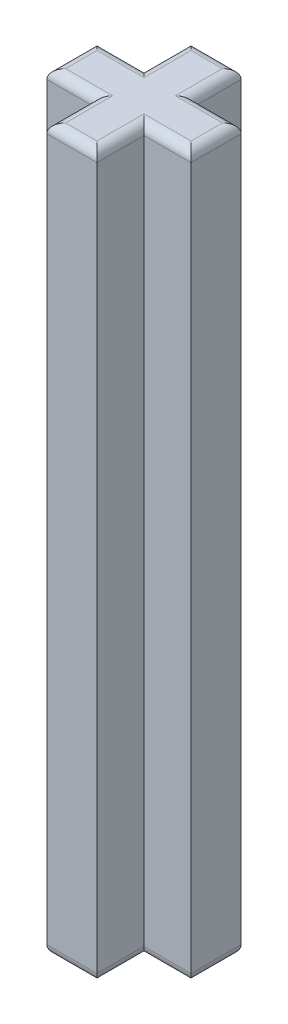
ISO-10303-21;
HEADER;
FILE_DESCRIPTION(('STEP AP214'),'2;1');
FILE_NAME('part.step','',(''),(''),'','','');
FILE_SCHEMA(('AUTOMOTIVE_DESIGN { 1 0 10303 214 1 1 1 1 }'));
ENDSEC;
DATA;
#1=APPLICATION_CONTEXT('core data for automotive mechanical design processes');
#2=APPLICATION_PROTOCOL_DEFINITION('international standard','automotive_design',2000,#1);
#3=PRODUCT_CONTEXT('',#1,'mechanical');
#4=PRODUCT('Part','Part','',(#3));
#5=PRODUCT_RELATED_PRODUCT_CATEGORY('part','',(#4));
#6=PRODUCT_DEFINITION_FORMATION('','',#4);
#7=PRODUCT_DEFINITION_CONTEXT('part definition',#1,'design');
#8=PRODUCT_DEFINITION('design','',#6,#7);
#9=PRODUCT_DEFINITION_SHAPE('','',#8);
#10=(LENGTH_UNIT() NAMED_UNIT(*) SI_UNIT(.MILLI.,.METRE.));
#11=(NAMED_UNIT(*) PLANE_ANGLE_UNIT() SI_UNIT($,.RADIAN.));
#12=(NAMED_UNIT(*) SI_UNIT($,.STERADIAN.) SOLID_ANGLE_UNIT());
#13=UNCERTAINTY_MEASURE_WITH_UNIT(LENGTH_MEASURE(1.E-05),#10,'distance_accuracy_value','');
#14=(GEOMETRIC_REPRESENTATION_CONTEXT(3) GLOBAL_UNCERTAINTY_ASSIGNED_CONTEXT((#13)) GLOBAL_UNIT_ASSIGNED_CONTEXT((#10,
#11,#12)) REPRESENTATION_CONTEXT('',''));
#15=CARTESIAN_POINT('',(0.,0.,0.));
#16=DIRECTION('',(0.,0.,1.));
#17=DIRECTION('',(1.,0.,0.));
#18=AXIS2_PLACEMENT_3D('',#15,#16,#17);
#19=CARTESIAN_POINT('',(2.3,23.,0.8));
#20=DIRECTION('',(-1.,0.,0.));
#21=DIRECTION('',(0.,0.,1.));
#22=AXIS2_PLACEMENT_3D('',#19,#20,#21);
#23=PLANE('',#22);
#24=DIRECTION('',(0.,-1.,0.));
#25=VECTOR('',#24,1.);
#26=CARTESIAN_POINT('',(2.3,23.,0.8));
#27=LINE('',#26,#25);
#28=CARTESIAN_POINT('',(2.3,22.7,0.8));
#29=VERTEX_POINT('',#28);
#30=CARTESIAN_POINT('',(2.3,0.300000000000002,0.8));
#31=VERTEX_POINT('',#30);
#32=EDGE_CURVE('E426',#29,#31,#27,.T.);
#33=ORIENTED_EDGE('',*,*,#32,.T.);
#34=DIRECTION('',(0.,0.,-1.));
#35=VECTOR('',#34,1.);
#36=CARTESIAN_POINT('',(2.3,0.300000000000002,-0.8));
#37=LINE('',#36,#35);
#38=CARTESIAN_POINT('',(2.3,0.300000000000002,-0.8));
#39=VERTEX_POINT('',#38);
#40=EDGE_CURVE('E347',#31,#39,#37,.T.);
#41=ORIENTED_EDGE('',*,*,#40,.T.);
#42=DIRECTION('',(0.,-1.,0.));
#43=VECTOR('',#42,1.);
#44=CARTESIAN_POINT('',(2.3,23.,-0.8));
#45=LINE('',#44,#43);
#46=CARTESIAN_POINT('',(2.3,22.7,-0.8));
#47=VERTEX_POINT('',#46);
#48=EDGE_CURVE('E226',#47,#39,#45,.T.);
#49=ORIENTED_EDGE('',*,*,#48,.F.);
#50=DIRECTION('',(0.,0.,-1.));
#51=VECTOR('',#50,1.);
#52=CARTESIAN_POINT('',(2.3,22.7,0.8));
#53=LINE('',#52,#51);
#54=EDGE_CURVE('E344',#47,#29,#53,.F.);
#55=ORIENTED_EDGE('',*,*,#54,.T.);
#56=EDGE_LOOP('',(#33,#41,#49,#55));
#57=FACE_BOUND('',#56,.T.);
#58=ADVANCED_FACE('F39',(#57),#23,.F.);
#59=CARTESIAN_POINT('',(0.8,23.,-0.8));
#60=DIRECTION('',(0.,0.,1.));
#61=DIRECTION('',(1.,0.,0.));
#62=AXIS2_PLACEMENT_3D('',#59,#60,#61);
#63=PLANE('',#62);
#64=ORIENTED_EDGE('',*,*,#48,.T.);
#65=DIRECTION('',(-1.,0.,0.));
#66=VECTOR('',#65,1.);
#67=CARTESIAN_POINT('',(0.8,0.300000000000002,-0.8));
#68=LINE('',#67,#66);
#69=CARTESIAN_POINT('',(0.8,0.300000000000002,-0.8));
#70=VERTEX_POINT('',#69);
#71=EDGE_CURVE('E224',#39,#70,#68,.T.);
#72=ORIENTED_EDGE('',*,*,#71,.T.);
#73=DIRECTION('',(0.,-1.,0.));
#74=VECTOR('',#73,1.);
#75=CARTESIAN_POINT('',(0.8,23.,-0.8));
#76=LINE('',#75,#74);
#77=CARTESIAN_POINT('',(0.8,22.7,-0.8));
#78=VERTEX_POINT('',#77);
#79=EDGE_CURVE('E205',#78,#70,#76,.T.);
#80=ORIENTED_EDGE('',*,*,#79,.F.);
#81=DIRECTION('',(-1.,0.,0.));
#82=VECTOR('',#81,1.);
#83=CARTESIAN_POINT('',(0.8,22.7,-0.8));
#84=LINE('',#83,#82);
#85=EDGE_CURVE('E221',#78,#47,#84,.F.);
#86=ORIENTED_EDGE('',*,*,#85,.T.);
#87=EDGE_LOOP('',(#64,#72,#80,#86));
#88=FACE_BOUND('',#87,.T.);
#89=ADVANCED_FACE('F219',(#88),#63,.F.);
#90=CARTESIAN_POINT('',(0.8,23.,-0.8));
#91=DIRECTION('',(-1.,0.,0.));
#92=DIRECTION('',(0.,0.,1.));
#93=AXIS2_PLACEMENT_3D('',#90,#91,#92);
#94=PLANE('',#93);
#95=ORIENTED_EDGE('',*,*,#79,.T.);
#96=DIRECTION('',(0.,0.,-1.));
#97=VECTOR('',#96,1.);
#98=CARTESIAN_POINT('',(0.8,0.300000000000002,-2.3));
#99=LINE('',#98,#97);
#100=CARTESIAN_POINT('',(0.8,0.300000000000002,-2.3));
#101=VERTEX_POINT('',#100);
#102=EDGE_CURVE('E213',#70,#101,#99,.T.);
#103=ORIENTED_EDGE('',*,*,#102,.T.);
#104=DIRECTION('',(0.,-1.,0.));
#105=VECTOR('',#104,1.);
#106=CARTESIAN_POINT('',(0.8,23.,-2.3));
#107=LINE('',#106,#105);
#108=CARTESIAN_POINT('',(0.8,22.7,-2.3));
#109=VERTEX_POINT('',#108);
#110=EDGE_CURVE('E207',#109,#101,#107,.T.);
#111=ORIENTED_EDGE('',*,*,#110,.F.);
#112=DIRECTION('',(0.,0.,-1.));
#113=VECTOR('',#112,1.);
#114=CARTESIAN_POINT('',(0.8,22.7,-0.8));
#115=LINE('',#114,#113);
#116=EDGE_CURVE('E202',#109,#78,#115,.F.);
#117=ORIENTED_EDGE('',*,*,#116,.T.);
#118=EDGE_LOOP('',(#95,#103,#111,#117));
#119=FACE_BOUND('',#118,.T.);
#120=ADVANCED_FACE('F204',(#119),#94,.F.);
#121=CARTESIAN_POINT('',(-0.8,23.,-2.3));
#122=DIRECTION('',(0.,0.,1.));
#123=DIRECTION('',(1.,0.,0.));
#124=AXIS2_PLACEMENT_3D('',#121,#122,#123);
#125=PLANE('',#124);
#126=ORIENTED_EDGE('',*,*,#110,.T.);
#127=DIRECTION('',(-1.,0.,0.));
#128=VECTOR('',#127,1.);
#129=CARTESIAN_POINT('',(-0.8,0.300000000000002,-2.3));
#130=LINE('',#129,#128);
#131=CARTESIAN_POINT('',(-0.8,0.300000000000002,-2.3));
#132=VERTEX_POINT('',#131);
#133=EDGE_CURVE('E292',#101,#132,#130,.T.);
#134=ORIENTED_EDGE('',*,*,#133,.T.);
#135=DIRECTION('',(0.,-1.,0.));
#136=VECTOR('',#135,1.);
#137=CARTESIAN_POINT('',(-0.8,23.,-2.3));
#138=LINE('',#137,#136);
#139=CARTESIAN_POINT('',(-0.8,22.7,-2.3));
#140=VERTEX_POINT('',#139);
#141=EDGE_CURVE('E488',#140,#132,#138,.T.);
#142=ORIENTED_EDGE('',*,*,#141,.F.);
#143=DIRECTION('',(-1.,0.,0.));
#144=VECTOR('',#143,1.);
#145=CARTESIAN_POINT('',(-0.8,22.7,-2.3));
#146=LINE('',#145,#144);
#147=EDGE_CURVE('E289',#140,#109,#146,.F.);
#148=ORIENTED_EDGE('',*,*,#147,.T.);
#149=EDGE_LOOP('',(#126,#134,#142,#148));
#150=FACE_BOUND('',#149,.T.);
#151=ADVANCED_FACE('F500',(#150),#125,.F.);
#152=CARTESIAN_POINT('',(-0.8,23.,-0.8));
#153=DIRECTION('',(1.,0.,0.));
#154=DIRECTION('',(0.,0.,-1.));
#155=AXIS2_PLACEMENT_3D('',#152,#153,#154);
#156=PLANE('',#155);
#157=ORIENTED_EDGE('',*,*,#141,.T.);
#158=DIRECTION('',(0.,0.,1.));
#159=VECTOR('',#158,1.);
#160=CARTESIAN_POINT('',(-0.8,0.300000000000002,-0.8));
#161=LINE('',#160,#159);
#162=CARTESIAN_POINT('',(-0.8,0.300000000000002,-0.8));
#163=VERTEX_POINT('',#162);
#164=EDGE_CURVE('E298',#132,#163,#161,.T.);
#165=ORIENTED_EDGE('',*,*,#164,.T.);
#166=DIRECTION('',(0.,-1.,0.));
#167=VECTOR('',#166,1.);
#168=CARTESIAN_POINT('',(-0.8,23.,-0.8));
#169=LINE('',#168,#167);
#170=CARTESIAN_POINT('',(-0.8,22.7,-0.8));
#171=VERTEX_POINT('',#170);
#172=EDGE_CURVE('E478',#171,#163,#169,.T.);
#173=ORIENTED_EDGE('',*,*,#172,.F.);
#174=DIRECTION('',(0.,0.,1.));
#175=VECTOR('',#174,1.);
#176=CARTESIAN_POINT('',(-0.8,22.7,-0.8));
#177=LINE('',#176,#175);
#178=EDGE_CURVE('E295',#171,#140,#177,.F.);
#179=ORIENTED_EDGE('',*,*,#178,.T.);
#180=EDGE_LOOP('',(#157,#165,#173,#179));
#181=FACE_BOUND('',#180,.T.);
#182=ADVANCED_FACE('F484',(#181),#156,.F.);
#183=CARTESIAN_POINT('',(-2.3,23.,-0.8));
#184=DIRECTION('',(0.,0.,1.));
#185=DIRECTION('',(1.,0.,0.));
#186=AXIS2_PLACEMENT_3D('',#183,#184,#185);
#187=PLANE('',#186);
#188=ORIENTED_EDGE('',*,*,#172,.T.);
#189=DIRECTION('',(-1.,0.,0.));
#190=VECTOR('',#189,1.);
#191=CARTESIAN_POINT('',(-2.3,0.300000000000002,-0.8));
#192=LINE('',#191,#190);
#193=CARTESIAN_POINT('',(-2.3,0.300000000000002,-0.8));
#194=VERTEX_POINT('',#193);
#195=EDGE_CURVE('E304',#163,#194,#192,.T.);
#196=ORIENTED_EDGE('',*,*,#195,.T.);
#197=DIRECTION('',(0.,-1.,0.));
#198=VECTOR('',#197,1.);
#199=CARTESIAN_POINT('',(-2.3,23.,-0.8));
#200=LINE('',#199,#198);
#201=CARTESIAN_POINT('',(-2.3,22.7,-0.8));
#202=VERTEX_POINT('',#201);
#203=EDGE_CURVE('E481',#202,#194,#200,.T.);
#204=ORIENTED_EDGE('',*,*,#203,.F.);
#205=DIRECTION('',(-1.,0.,0.));
#206=VECTOR('',#205,1.);
#207=CARTESIAN_POINT('',(-2.3,22.7,-0.8));
#208=LINE('',#207,#206);
#209=EDGE_CURVE('E301',#202,#171,#208,.F.);
#210=ORIENTED_EDGE('',*,*,#209,.T.);
#211=EDGE_LOOP('',(#188,#196,#204,#210));
#212=FACE_BOUND('',#211,.T.);
#213=ADVANCED_FACE('F477',(#212),#187,.F.);
#214=CARTESIAN_POINT('',(-2.3,23.,0.8));
#215=DIRECTION('',(1.,0.,0.));
#216=DIRECTION('',(0.,0.,-1.));
#217=AXIS2_PLACEMENT_3D('',#214,#215,#216);
#218=PLANE('',#217);
#219=ORIENTED_EDGE('',*,*,#203,.T.);
#220=DIRECTION('',(0.,0.,1.));
#221=VECTOR('',#220,1.);
#222=CARTESIAN_POINT('',(-2.3,0.300000000000002,0.8));
#223=LINE('',#222,#221);
#224=CARTESIAN_POINT('',(-2.3,0.300000000000002,0.8));
#225=VERTEX_POINT('',#224);
#226=EDGE_CURVE('E310',#194,#225,#223,.T.);
#227=ORIENTED_EDGE('',*,*,#226,.T.);
#228=DIRECTION('',(0.,-1.,0.));
#229=VECTOR('',#228,1.);
#230=CARTESIAN_POINT('',(-2.3,23.,0.8));
#231=LINE('',#230,#229);
#232=CARTESIAN_POINT('',(-2.3,22.7,0.8));
#233=VERTEX_POINT('',#232);
#234=EDGE_CURVE('E493',#233,#225,#231,.T.);
#235=ORIENTED_EDGE('',*,*,#234,.F.);
#236=DIRECTION('',(0.,0.,1.));
#237=VECTOR('',#236,1.);
#238=CARTESIAN_POINT('',(-2.3,22.7,0.8));
#239=LINE('',#238,#237);
#240=EDGE_CURVE('E307',#233,#202,#239,.F.);
#241=ORIENTED_EDGE('',*,*,#240,.T.);
#242=EDGE_LOOP('',(#219,#227,#235,#241));
#243=FACE_BOUND('',#242,.T.);
#244=ADVANCED_FACE('F826',(#243),#218,.F.);
#245=CARTESIAN_POINT('',(-2.3,23.,0.8));
#246=DIRECTION('',(0.,0.,-1.));
#247=DIRECTION('',(-1.,0.,0.));
#248=AXIS2_PLACEMENT_3D('',#245,#246,#247);
#249=PLANE('',#248);
#250=ORIENTED_EDGE('',*,*,#234,.T.);
#251=DIRECTION('',(1.,0.,0.));
#252=VECTOR('',#251,1.);
#253=CARTESIAN_POINT('',(-0.8,0.300000000000002,0.8));
#254=LINE('',#253,#252);
#255=CARTESIAN_POINT('',(-0.8,0.300000000000002,0.8));
#256=VERTEX_POINT('',#255);
#257=EDGE_CURVE('E316',#225,#256,#254,.T.);
#258=ORIENTED_EDGE('',*,*,#257,.T.);
#259=DIRECTION('',(0.,-1.,0.));
#260=VECTOR('',#259,1.);
#261=CARTESIAN_POINT('',(-0.8,23.,0.8));
#262=LINE('',#261,#260);
#263=CARTESIAN_POINT('',(-0.8,22.7,0.8));
#264=VERTEX_POINT('',#263);
#265=EDGE_CURVE('E895',#264,#256,#262,.T.);
#266=ORIENTED_EDGE('',*,*,#265,.F.);
#267=DIRECTION('',(1.,0.,0.));
#268=VECTOR('',#267,1.);
#269=CARTESIAN_POINT('',(-2.3,22.7,0.8));
#270=LINE('',#269,#268);
#271=EDGE_CURVE('E313',#264,#233,#270,.F.);
#272=ORIENTED_EDGE('',*,*,#271,.T.);
#273=EDGE_LOOP('',(#250,#258,#266,#272));
#274=FACE_BOUND('',#273,.T.);
#275=ADVANCED_FACE('F817',(#274),#249,.F.);
#276=CARTESIAN_POINT('',(-0.8,23.,2.3));
#277=DIRECTION('',(1.,0.,0.));
#278=DIRECTION('',(0.,0.,-1.));
#279=AXIS2_PLACEMENT_3D('',#276,#277,#278);
#280=PLANE('',#279);
#281=ORIENTED_EDGE('',*,*,#265,.T.);
#282=DIRECTION('',(0.,0.,1.));
#283=VECTOR('',#282,1.);
#284=CARTESIAN_POINT('',(-0.8,0.300000000000002,2.3));
#285=LINE('',#284,#283);
#286=CARTESIAN_POINT('',(-0.8,0.300000000000002,2.3));
#287=VERTEX_POINT('',#286);
#288=EDGE_CURVE('E322',#256,#287,#285,.T.);
#289=ORIENTED_EDGE('',*,*,#288,.T.);
#290=DIRECTION('',(0.,-1.,0.));
#291=VECTOR('',#290,1.);
#292=CARTESIAN_POINT('',(-0.8,23.,2.3));
#293=LINE('',#292,#291);
#294=CARTESIAN_POINT('',(-0.8,22.7,2.3));
#295=VERTEX_POINT('',#294);
#296=EDGE_CURVE('E898',#295,#287,#293,.T.);
#297=ORIENTED_EDGE('',*,*,#296,.F.);
#298=DIRECTION('',(0.,0.,1.));
#299=VECTOR('',#298,1.);
#300=CARTESIAN_POINT('',(-0.8,22.7,2.3));
#301=LINE('',#300,#299);
#302=EDGE_CURVE('E319',#295,#264,#301,.F.);
#303=ORIENTED_EDGE('',*,*,#302,.T.);
#304=EDGE_LOOP('',(#281,#289,#297,#303));
#305=FACE_BOUND('',#304,.T.);
#306=ADVANCED_FACE('F808',(#305),#280,.F.);
#307=CARTESIAN_POINT('',(-0.8,23.,2.3));
#308=DIRECTION('',(0.,0.,-1.));
#309=DIRECTION('',(-1.,0.,0.));
#310=AXIS2_PLACEMENT_3D('',#307,#308,#309);
#311=PLANE('',#310);
#312=ORIENTED_EDGE('',*,*,#296,.T.);
#313=DIRECTION('',(1.,0.,0.));
#314=VECTOR('',#313,1.);
#315=CARTESIAN_POINT('',(0.8,0.300000000000002,2.3));
#316=LINE('',#315,#314);
#317=CARTESIAN_POINT('',(0.8,0.300000000000002,2.3));
#318=VERTEX_POINT('',#317);
#319=EDGE_CURVE('E328',#287,#318,#316,.T.);
#320=ORIENTED_EDGE('',*,*,#319,.T.);
#321=DIRECTION('',(0.,-1.,0.));
#322=VECTOR('',#321,1.);
#323=CARTESIAN_POINT('',(0.8,23.,2.3));
#324=LINE('',#323,#322);
#325=CARTESIAN_POINT('',(0.8,22.7,2.3));
#326=VERTEX_POINT('',#325);
#327=EDGE_CURVE('E904',#326,#318,#324,.T.);
#328=ORIENTED_EDGE('',*,*,#327,.F.);
#329=DIRECTION('',(1.,0.,0.));
#330=VECTOR('',#329,1.);
#331=CARTESIAN_POINT('',(-0.8,22.7,2.3));
#332=LINE('',#331,#330);
#333=EDGE_CURVE('E325',#326,#295,#332,.F.);
#334=ORIENTED_EDGE('',*,*,#333,.T.);
#335=EDGE_LOOP('',(#312,#320,#328,#334));
#336=FACE_BOUND('',#335,.T.);
#337=ADVANCED_FACE('F799',(#336),#311,.F.);
#338=CARTESIAN_POINT('',(0.8,23.,2.3));
#339=DIRECTION('',(-1.,0.,0.));
#340=DIRECTION('',(0.,0.,1.));
#341=AXIS2_PLACEMENT_3D('',#338,#339,#340);
#342=PLANE('',#341);
#343=ORIENTED_EDGE('',*,*,#327,.T.);
#344=DIRECTION('',(0.,0.,-1.));
#345=VECTOR('',#344,1.);
#346=CARTESIAN_POINT('',(0.799999999999999,0.300000000000002,0.8));
#347=LINE('',#346,#345);
#348=CARTESIAN_POINT('',(0.799999999999999,0.300000000000002,0.8));
#349=VERTEX_POINT('',#348);
#350=EDGE_CURVE('E334',#318,#349,#347,.T.);
#351=ORIENTED_EDGE('',*,*,#350,.T.);
#352=DIRECTION('',(0.,-1.,0.));
#353=VECTOR('',#352,1.);
#354=CARTESIAN_POINT('',(0.799999999999999,23.,0.8));
#355=LINE('',#354,#353);
#356=CARTESIAN_POINT('',(0.799999999999999,22.7,0.8));
#357=VERTEX_POINT('',#356);
#358=EDGE_CURVE('E908',#357,#349,#355,.T.);
#359=ORIENTED_EDGE('',*,*,#358,.F.);
#360=DIRECTION('',(0.,0.,-1.));
#361=VECTOR('',#360,1.);
#362=CARTESIAN_POINT('',(0.8,22.7,2.3));
#363=LINE('',#362,#361);
#364=EDGE_CURVE('E331',#357,#326,#363,.F.);
#365=ORIENTED_EDGE('',*,*,#364,.T.);
#366=EDGE_LOOP('',(#343,#351,#359,#365));
#367=FACE_BOUND('',#366,.T.);
#368=ADVANCED_FACE('F790',(#367),#342,.F.);
#369=CARTESIAN_POINT('',(0.799999999999999,23.,0.8));
#370=DIRECTION('',(0.,0.,-1.));
#371=DIRECTION('',(-1.,0.,0.));
#372=AXIS2_PLACEMENT_3D('',#369,#370,#371);
#373=PLANE('',#372);
#374=ORIENTED_EDGE('',*,*,#358,.T.);
#375=DIRECTION('',(1.,0.,0.));
#376=VECTOR('',#375,1.);
#377=CARTESIAN_POINT('',(2.3,0.300000000000002,0.8));
#378=LINE('',#377,#376);
#379=EDGE_CURVE('E341',#349,#31,#378,.T.);
#380=ORIENTED_EDGE('',*,*,#379,.T.);
#381=ORIENTED_EDGE('',*,*,#32,.F.);
#382=DIRECTION('',(1.,0.,0.));
#383=VECTOR('',#382,1.);
#384=CARTESIAN_POINT('',(0.799999999999999,22.7,0.8));
#385=LINE('',#384,#383);
#386=EDGE_CURVE('E337',#29,#357,#385,.F.);
#387=ORIENTED_EDGE('',*,*,#386,.T.);
#388=EDGE_LOOP('',(#374,#380,#381,#387));
#389=FACE_BOUND('',#388,.T.);
#390=ADVANCED_FACE('F782',(#389),#373,.F.);
#391=CARTESIAN_POINT('',(0.,23.,0.));
#392=DIRECTION('',(0.,-1.,0.));
#393=DIRECTION('',(0.,0.,-1.));
#394=AXIS2_PLACEMENT_3D('',#391,#392,#393);
#395=PLANE('',#394);
#396=DIRECTION('',(0.,0.,-1.));
#397=VECTOR('',#396,1.);
#398=CARTESIAN_POINT('',(0.499999999999999,23.,0.));
#399=LINE('',#398,#397);
#400=CARTESIAN_POINT('',(0.5,23.,2.));
#401=VERTEX_POINT('',#400);
#402=CARTESIAN_POINT('',(0.5,23.,0.5));
#403=VERTEX_POINT('',#402);
#404=EDGE_CURVE('E49',#401,#403,#399,.T.);
#405=ORIENTED_EDGE('',*,*,#404,.T.);
#406=DIRECTION('',(1.,0.,0.));
#407=VECTOR('',#406,1.);
#408=CARTESIAN_POINT('',(0.,23.,0.500000000000001));
#409=LINE('',#408,#407);
#410=CARTESIAN_POINT('',(2.,23.,0.5));
#411=VERTEX_POINT('',#410);
#412=EDGE_CURVE('E11',#403,#411,#409,.T.);
#413=ORIENTED_EDGE('',*,*,#412,.T.);
#414=DIRECTION('',(0.,0.,-1.));
#415=VECTOR('',#414,1.);
#416=CARTESIAN_POINT('',(2.,23.,0.));
#417=LINE('',#416,#415);
#418=CARTESIAN_POINT('',(2.,23.,-0.5));
#419=VERTEX_POINT('',#418);
#420=EDGE_CURVE('E350',#411,#419,#417,.T.);
#421=ORIENTED_EDGE('',*,*,#420,.T.);
#422=DIRECTION('',(-1.,0.,0.));
#423=VECTOR('',#422,1.);
#424=CARTESIAN_POINT('',(0.,23.,-0.5));
#425=LINE('',#424,#423);
#426=CARTESIAN_POINT('',(0.5,23.,-0.5));
#427=VERTEX_POINT('',#426);
#428=EDGE_CURVE('E353',#419,#427,#425,.T.);
#429=ORIENTED_EDGE('',*,*,#428,.T.);
#430=DIRECTION('',(0.,0.,-1.));
#431=VECTOR('',#430,1.);
#432=CARTESIAN_POINT('',(0.499999999999999,23.,0.));
#433=LINE('',#432,#431);
#434=CARTESIAN_POINT('',(0.5,23.,-2.));
#435=VERTEX_POINT('',#434);
#436=EDGE_CURVE('E232',#427,#435,#433,.T.);
#437=ORIENTED_EDGE('',*,*,#436,.T.);
#438=DIRECTION('',(-1.,0.,0.));
#439=VECTOR('',#438,1.);
#440=CARTESIAN_POINT('',(0.,23.,-2.));
#441=LINE('',#440,#439);
#442=CARTESIAN_POINT('',(-0.5,23.,-2.));
#443=VERTEX_POINT('',#442);
#444=EDGE_CURVE('E358',#435,#443,#441,.T.);
#445=ORIENTED_EDGE('',*,*,#444,.T.);
#446=DIRECTION('',(0.,0.,1.));
#447=VECTOR('',#446,1.);
#448=CARTESIAN_POINT('',(-0.5,23.,0.));
#449=LINE('',#448,#447);
#450=CARTESIAN_POINT('',(-0.5,23.,-0.5));
#451=VERTEX_POINT('',#450);
#452=EDGE_CURVE('E361',#443,#451,#449,.T.);
#453=ORIENTED_EDGE('',*,*,#452,.T.);
#454=DIRECTION('',(-1.,0.,0.));
#455=VECTOR('',#454,1.);
#456=CARTESIAN_POINT('',(0.,23.,-0.5));
#457=LINE('',#456,#455);
#458=CARTESIAN_POINT('',(-2.,23.,-0.5));
#459=VERTEX_POINT('',#458);
#460=EDGE_CURVE('E364',#451,#459,#457,.T.);
#461=ORIENTED_EDGE('',*,*,#460,.T.);
#462=DIRECTION('',(0.,0.,1.));
#463=VECTOR('',#462,1.);
#464=CARTESIAN_POINT('',(-2.,23.,0.));
#465=LINE('',#464,#463);
#466=CARTESIAN_POINT('',(-2.,23.,0.5));
#467=VERTEX_POINT('',#466);
#468=EDGE_CURVE('E367',#459,#467,#465,.T.);
#469=ORIENTED_EDGE('',*,*,#468,.T.);
#470=DIRECTION('',(1.,0.,0.));
#471=VECTOR('',#470,1.);
#472=CARTESIAN_POINT('',(0.,23.,0.5));
#473=LINE('',#472,#471);
#474=CARTESIAN_POINT('',(-0.5,23.,0.5));
#475=VERTEX_POINT('',#474);
#476=EDGE_CURVE('E370',#467,#475,#473,.T.);
#477=ORIENTED_EDGE('',*,*,#476,.T.);
#478=DIRECTION('',(0.,0.,1.));
#479=VECTOR('',#478,1.);
#480=CARTESIAN_POINT('',(-0.5,23.,0.));
#481=LINE('',#480,#479);
#482=CARTESIAN_POINT('',(-0.5,23.,2.));
#483=VERTEX_POINT('',#482);
#484=EDGE_CURVE('E373',#475,#483,#481,.T.);
#485=ORIENTED_EDGE('',*,*,#484,.T.);
#486=DIRECTION('',(1.,0.,0.));
#487=VECTOR('',#486,1.);
#488=CARTESIAN_POINT('',(0.,23.,2.));
#489=LINE('',#488,#487);
#490=EDGE_CURVE('E60',#483,#401,#489,.T.);
#491=ORIENTED_EDGE('',*,*,#490,.T.);
#492=EDGE_LOOP('',(#405,#413,#421,#429,#437,#445,#453,#461,#469,#477,#485,#491));
#493=FACE_BOUND('',#492,.T.);
#494=ADVANCED_FACE('F774',(#493),#395,.F.);
#495=CARTESIAN_POINT('',(0.,0.,0.));
#496=DIRECTION('',(0.,-1.,0.));
#497=DIRECTION('',(0.,0.,-1.));
#498=AXIS2_PLACEMENT_3D('',#495,#496,#497);
#499=PLANE('',#498);
#500=DIRECTION('',(0.,0.,-1.));
#501=VECTOR('',#500,1.);
#502=CARTESIAN_POINT('',(0.5,0.,-0.8));
#503=LINE('',#502,#501);
#504=CARTESIAN_POINT('',(0.5,0.,-2.));
#505=VERTEX_POINT('',#504);
#506=CARTESIAN_POINT('',(0.5,0.,-0.5));
#507=VERTEX_POINT('',#506);
#508=EDGE_CURVE('E281',#505,#507,#503,.F.);
#509=ORIENTED_EDGE('',*,*,#508,.T.);
#510=DIRECTION('',(-1.,0.,0.));
#511=VECTOR('',#510,1.);
#512=CARTESIAN_POINT('',(2.3,0.,-0.5));
#513=LINE('',#512,#511);
#514=CARTESIAN_POINT('',(2.,0.,-0.5));
#515=VERTEX_POINT('',#514);
#516=EDGE_CURVE('E214',#507,#515,#513,.F.);
#517=ORIENTED_EDGE('',*,*,#516,.T.);
#518=DIRECTION('',(0.,0.,-1.));
#519=VECTOR('',#518,1.);
#520=CARTESIAN_POINT('',(2.,0.,0.8));
#521=LINE('',#520,#519);
#522=CARTESIAN_POINT('',(2.,0.,0.5));
#523=VERTEX_POINT('',#522);
#524=EDGE_CURVE('E248',#515,#523,#521,.F.);
#525=ORIENTED_EDGE('',*,*,#524,.T.);
#526=DIRECTION('',(1.,0.,0.));
#527=VECTOR('',#526,1.);
#528=CARTESIAN_POINT('',(0.799999999999999,0.,0.5));
#529=LINE('',#528,#527);
#530=CARTESIAN_POINT('',(0.5,0.,0.5));
#531=VERTEX_POINT('',#530);
#532=EDGE_CURVE('E254',#523,#531,#529,.F.);
#533=ORIENTED_EDGE('',*,*,#532,.T.);
#534=DIRECTION('',(0.,0.,-1.));
#535=VECTOR('',#534,1.);
#536=CARTESIAN_POINT('',(0.5,0.,2.3));
#537=LINE('',#536,#535);
#538=CARTESIAN_POINT('',(0.5,0.,2.));
#539=VERTEX_POINT('',#538);
#540=EDGE_CURVE('E257',#531,#539,#537,.F.);
#541=ORIENTED_EDGE('',*,*,#540,.T.);
#542=DIRECTION('',(1.,0.,0.));
#543=VECTOR('',#542,1.);
#544=CARTESIAN_POINT('',(-0.8,0.,2.));
#545=LINE('',#544,#543);
#546=CARTESIAN_POINT('',(-0.5,0.,2.));
#547=VERTEX_POINT('',#546);
#548=EDGE_CURVE('E260',#539,#547,#545,.F.);
#549=ORIENTED_EDGE('',*,*,#548,.T.);
#550=DIRECTION('',(0.,0.,1.));
#551=VECTOR('',#550,1.);
#552=CARTESIAN_POINT('',(-0.5,0.,0.8));
#553=LINE('',#552,#551);
#554=CARTESIAN_POINT('',(-0.5,0.,0.5));
#555=VERTEX_POINT('',#554);
#556=EDGE_CURVE('E263',#547,#555,#553,.F.);
#557=ORIENTED_EDGE('',*,*,#556,.T.);
#558=DIRECTION('',(1.,0.,0.));
#559=VECTOR('',#558,1.);
#560=CARTESIAN_POINT('',(-2.3,0.,0.5));
#561=LINE('',#560,#559);
#562=CARTESIAN_POINT('',(-2.,0.,0.5));
#563=VERTEX_POINT('',#562);
#564=EDGE_CURVE('E266',#555,#563,#561,.F.);
#565=ORIENTED_EDGE('',*,*,#564,.T.);
#566=DIRECTION('',(0.,0.,1.));
#567=VECTOR('',#566,1.);
#568=CARTESIAN_POINT('',(-2.,0.,-0.8));
#569=LINE('',#568,#567);
#570=CARTESIAN_POINT('',(-2.,0.,-0.5));
#571=VERTEX_POINT('',#570);
#572=EDGE_CURVE('E269',#563,#571,#569,.F.);
#573=ORIENTED_EDGE('',*,*,#572,.T.);
#574=DIRECTION('',(-1.,0.,0.));
#575=VECTOR('',#574,1.);
#576=CARTESIAN_POINT('',(-0.8,0.,-0.5));
#577=LINE('',#576,#575);
#578=CARTESIAN_POINT('',(-0.5,0.,-0.5));
#579=VERTEX_POINT('',#578);
#580=EDGE_CURVE('E272',#571,#579,#577,.F.);
#581=ORIENTED_EDGE('',*,*,#580,.T.);
#582=DIRECTION('',(0.,0.,1.));
#583=VECTOR('',#582,1.);
#584=CARTESIAN_POINT('',(-0.5,0.,-2.3));
#585=LINE('',#584,#583);
#586=CARTESIAN_POINT('',(-0.5,0.,-2.));
#587=VERTEX_POINT('',#586);
#588=EDGE_CURVE('E275',#579,#587,#585,.F.);
#589=ORIENTED_EDGE('',*,*,#588,.T.);
#590=DIRECTION('',(-1.,0.,0.));
#591=VECTOR('',#590,1.);
#592=CARTESIAN_POINT('',(0.8,0.,-2.));
#593=LINE('',#592,#591);
#594=EDGE_CURVE('E278',#587,#505,#593,.F.);
#595=ORIENTED_EDGE('',*,*,#594,.T.);
#596=EDGE_LOOP('',(#509,#517,#525,#533,#541,#549,#557,#565,#573,#581,#589,#595));
#597=FACE_BOUND('',#596,.T.);
#598=ADVANCED_FACE('F514',(#597),#499,.T.);
#599=CARTESIAN_POINT('',(-2.3,0.300000000000002,0.5));
#600=DIRECTION('',(-1.,0.,0.));
#601=DIRECTION('',(0.,0.,1.));
#602=AXIS2_PLACEMENT_3D('',#599,#600,#601);
#603=CYLINDRICAL_SURFACE('',#602,0.3);
#604=CARTESIAN_POINT('',(-2.,0.300000000000002,0.5));
#605=DIRECTION('',(-0.707106781186547,0.,-0.707106781186547));
#606=DIRECTION('',(-0.707106781186548,0.,0.707106781186547));
#607=AXIS2_PLACEMENT_3D('',#604,#605,#606);
#608=ELLIPSE('',#607,0.424264068711928,0.3);
#609=EDGE_CURVE('E418',#563,#225,#608,.T.);
#610=ORIENTED_EDGE('',*,*,#609,.F.);
#611=ORIENTED_EDGE('',*,*,#564,.F.);
#612=CARTESIAN_POINT('',(-0.5,0.300000000000002,0.5));
#613=DIRECTION('',(-0.707106781186547,0.,-0.707106781186547));
#614=DIRECTION('',(-0.707106781186548,0.,0.707106781186547));
#615=AXIS2_PLACEMENT_3D('',#612,#613,#614);
#616=ELLIPSE('',#615,0.424264068711928,0.3);
#617=EDGE_CURVE('E422',#256,#555,#616,.F.);
#618=ORIENTED_EDGE('',*,*,#617,.F.);
#619=ORIENTED_EDGE('',*,*,#257,.F.);
#620=EDGE_LOOP('',(#610,#611,#618,#619));
#621=FACE_BOUND('',#620,.T.);
#622=ADVANCED_FACE('F546',(#621),#603,.T.);
#623=CARTESIAN_POINT('',(-0.5,0.300000000000002,2.3));
#624=DIRECTION('',(0.,0.,-1.));
#625=DIRECTION('',(-1.,0.,0.));
#626=AXIS2_PLACEMENT_3D('',#623,#624,#625);
#627=CYLINDRICAL_SURFACE('',#626,0.3);
#628=ORIENTED_EDGE('',*,*,#617,.T.);
#629=ORIENTED_EDGE('',*,*,#556,.F.);
#630=CARTESIAN_POINT('',(-0.5,0.300000000000002,2.));
#631=DIRECTION('',(-0.707106781186547,0.,-0.707106781186547));
#632=DIRECTION('',(-0.707106781186547,0.,0.707106781186547));
#633=AXIS2_PLACEMENT_3D('',#630,#631,#632);
#634=ELLIPSE('',#633,0.424264068711928,0.3);
#635=EDGE_CURVE('E414',#287,#547,#634,.F.);
#636=ORIENTED_EDGE('',*,*,#635,.F.);
#637=ORIENTED_EDGE('',*,*,#288,.F.);
#638=EDGE_LOOP('',(#628,#629,#636,#637));
#639=FACE_BOUND('',#638,.T.);
#640=ADVANCED_FACE('F541',(#639),#627,.T.);
#641=CARTESIAN_POINT('',(-2.,0.300000000000002,0.8));
#642=DIRECTION('',(0.,0.,-1.));
#643=DIRECTION('',(-1.,0.,0.));
#644=AXIS2_PLACEMENT_3D('',#641,#642,#643);
#645=CYLINDRICAL_SURFACE('',#644,0.3);
#646=ORIENTED_EDGE('',*,*,#609,.T.);
#647=ORIENTED_EDGE('',*,*,#226,.F.);
#648=CARTESIAN_POINT('',(-2.,0.300000000000002,-0.5));
#649=DIRECTION('',(0.707106781186547,0.,-0.707106781186547));
#650=DIRECTION('',(-0.707106781186548,0.,-0.707106781186547));
#651=AXIS2_PLACEMENT_3D('',#648,#649,#650);
#652=ELLIPSE('',#651,0.424264068711928,0.3);
#653=EDGE_CURVE('E410',#571,#194,#652,.T.);
#654=ORIENTED_EDGE('',*,*,#653,.F.);
#655=ORIENTED_EDGE('',*,*,#572,.F.);
#656=EDGE_LOOP('',(#646,#647,#654,#655));
#657=FACE_BOUND('',#656,.T.);
#658=ADVANCED_FACE('F552',(#657),#645,.T.);
#659=CARTESIAN_POINT('',(-0.8,0.300000000000002,2.));
#660=DIRECTION('',(-1.,0.,0.));
#661=DIRECTION('',(0.,0.,1.));
#662=AXIS2_PLACEMENT_3D('',#659,#660,#661);
#663=CYLINDRICAL_SURFACE('',#662,0.3);
#664=ORIENTED_EDGE('',*,*,#635,.T.);
#665=ORIENTED_EDGE('',*,*,#548,.F.);
#666=CARTESIAN_POINT('',(0.5,0.300000000000002,2.));
#667=DIRECTION('',(-0.707106781186547,0.,0.707106781186548));
#668=DIRECTION('',(0.707106781186548,0.,0.707106781186547));
#669=AXIS2_PLACEMENT_3D('',#666,#667,#668);
#670=ELLIPSE('',#669,0.424264068711929,0.3);
#671=EDGE_CURVE('E406',#318,#539,#670,.F.);
#672=ORIENTED_EDGE('',*,*,#671,.F.);
#673=ORIENTED_EDGE('',*,*,#319,.F.);
#674=EDGE_LOOP('',(#664,#665,#672,#673));
#675=FACE_BOUND('',#674,.T.);
#676=ADVANCED_FACE('F536',(#675),#663,.T.);
#677=CARTESIAN_POINT('',(-2.3,0.300000000000002,-0.5));
#678=DIRECTION('',(1.,0.,0.));
#679=DIRECTION('',(0.,0.,-1.));
#680=AXIS2_PLACEMENT_3D('',#677,#678,#679);
#681=CYLINDRICAL_SURFACE('',#680,0.3);
#682=ORIENTED_EDGE('',*,*,#653,.T.);
#683=ORIENTED_EDGE('',*,*,#195,.F.);
#684=CARTESIAN_POINT('',(-0.5,0.300000000000002,-0.5));
#685=DIRECTION('',(0.707106781186547,0.,-0.707106781186547));
#686=DIRECTION('',(-0.707106781186548,0.,-0.707106781186547));
#687=AXIS2_PLACEMENT_3D('',#684,#685,#686);
#688=ELLIPSE('',#687,0.424264068711928,0.3);
#689=EDGE_CURVE('E402',#579,#163,#688,.T.);
#690=ORIENTED_EDGE('',*,*,#689,.F.);
#691=ORIENTED_EDGE('',*,*,#580,.F.);
#692=EDGE_LOOP('',(#682,#683,#690,#691));
#693=FACE_BOUND('',#692,.T.);
#694=ADVANCED_FACE('F557',(#693),#681,.T.);
#695=CARTESIAN_POINT('',(0.5,0.300000000000002,2.3));
#696=DIRECTION('',(0.,0.,1.));
#697=DIRECTION('',(1.,0.,0.));
#698=AXIS2_PLACEMENT_3D('',#695,#696,#697);
#699=CYLINDRICAL_SURFACE('',#698,0.3);
#700=ORIENTED_EDGE('',*,*,#671,.T.);
#701=ORIENTED_EDGE('',*,*,#540,.F.);
#702=CARTESIAN_POINT('',(0.5,0.300000000000002,0.5));
#703=DIRECTION('',(-0.707106781186547,0.,0.707106781186548));
#704=DIRECTION('',(0.707106781186548,0.,0.707106781186547));
#705=AXIS2_PLACEMENT_3D('',#702,#703,#704);
#706=ELLIPSE('',#705,0.424264068711929,0.3);
#707=EDGE_CURVE('E398',#349,#531,#706,.F.);
#708=ORIENTED_EDGE('',*,*,#707,.F.);
#709=ORIENTED_EDGE('',*,*,#350,.F.);
#710=EDGE_LOOP('',(#700,#701,#708,#709));
#711=FACE_BOUND('',#710,.T.);
#712=ADVANCED_FACE('F531',(#711),#699,.T.);
#713=CARTESIAN_POINT('',(-0.5,0.300000000000002,-0.8));
#714=DIRECTION('',(0.,0.,-1.));
#715=DIRECTION('',(-1.,0.,0.));
#716=AXIS2_PLACEMENT_3D('',#713,#714,#715);
#717=CYLINDRICAL_SURFACE('',#716,0.3);
#718=ORIENTED_EDGE('',*,*,#689,.T.);
#719=ORIENTED_EDGE('',*,*,#164,.F.);
#720=CARTESIAN_POINT('',(-0.5,0.300000000000002,-2.));
#721=DIRECTION('',(0.707106781186547,0.,-0.707106781186547));
#722=DIRECTION('',(-0.707106781186547,0.,-0.707106781186547));
#723=AXIS2_PLACEMENT_3D('',#720,#721,#722);
#724=ELLIPSE('',#723,0.424264068711928,0.3);
#725=EDGE_CURVE('E394',#587,#132,#724,.T.);
#726=ORIENTED_EDGE('',*,*,#725,.F.);
#727=ORIENTED_EDGE('',*,*,#588,.F.);
#728=EDGE_LOOP('',(#718,#719,#726,#727));
#729=FACE_BOUND('',#728,.T.);
#730=ADVANCED_FACE('F559',(#729),#717,.T.);
#731=CARTESIAN_POINT('',(0.799999999999999,0.300000000000002,0.5));
#732=DIRECTION('',(-1.,0.,0.));
#733=DIRECTION('',(0.,0.,1.));
#734=AXIS2_PLACEMENT_3D('',#731,#732,#733);
#735=CYLINDRICAL_SURFACE('',#734,0.3);
#736=ORIENTED_EDGE('',*,*,#707,.T.);
#737=ORIENTED_EDGE('',*,*,#532,.F.);
#738=CARTESIAN_POINT('',(2.,0.300000000000002,0.5));
#739=DIRECTION('',(-0.707106781186547,0.,0.707106781186547));
#740=DIRECTION('',(0.707106781186548,0.,0.707106781186547));
#741=AXIS2_PLACEMENT_3D('',#738,#739,#740);
#742=ELLIPSE('',#741,0.424264068711928,0.3);
#743=EDGE_CURVE('E390',#31,#523,#742,.F.);
#744=ORIENTED_EDGE('',*,*,#743,.F.);
#745=ORIENTED_EDGE('',*,*,#379,.F.);
#746=EDGE_LOOP('',(#736,#737,#744,#745));
#747=FACE_BOUND('',#746,.T.);
#748=ADVANCED_FACE('F526',(#747),#735,.T.);
#749=CARTESIAN_POINT('',(-0.8,0.300000000000002,-2.));
#750=DIRECTION('',(1.,0.,0.));
#751=DIRECTION('',(0.,0.,-1.));
#752=AXIS2_PLACEMENT_3D('',#749,#750,#751);
#753=CYLINDRICAL_SURFACE('',#752,0.3);
#754=ORIENTED_EDGE('',*,*,#725,.T.);
#755=ORIENTED_EDGE('',*,*,#133,.F.);
#756=CARTESIAN_POINT('',(0.5,0.300000000000002,-2.));
#757=DIRECTION('',(0.707106781186547,0.,0.707106781186548));
#758=DIRECTION('',(0.707106781186547,0.,-0.707106781186547));
#759=AXIS2_PLACEMENT_3D('',#756,#757,#758);
#760=ELLIPSE('',#759,0.424264068711929,0.3);
#761=EDGE_CURVE('E386',#505,#101,#760,.T.);
#762=ORIENTED_EDGE('',*,*,#761,.F.);
#763=ORIENTED_EDGE('',*,*,#594,.F.);
#764=EDGE_LOOP('',(#754,#755,#762,#763));
#765=FACE_BOUND('',#764,.T.);
#766=ADVANCED_FACE('F504',(#765),#753,.T.);
#767=CARTESIAN_POINT('',(2.,0.300000000000002,0.8));
#768=DIRECTION('',(0.,0.,1.));
#769=DIRECTION('',(1.,0.,0.));
#770=AXIS2_PLACEMENT_3D('',#767,#768,#769);
#771=CYLINDRICAL_SURFACE('',#770,0.3);
#772=ORIENTED_EDGE('',*,*,#743,.T.);
#773=ORIENTED_EDGE('',*,*,#524,.F.);
#774=CARTESIAN_POINT('',(2.,0.300000000000002,-0.5));
#775=DIRECTION('',(0.707106781186547,0.,0.707106781186547));
#776=DIRECTION('',(-0.707106781186548,0.,0.707106781186547));
#777=AXIS2_PLACEMENT_3D('',#774,#775,#776);
#778=ELLIPSE('',#777,0.424264068711928,0.3);
#779=EDGE_CURVE('E383',#39,#515,#778,.F.);
#780=ORIENTED_EDGE('',*,*,#779,.F.);
#781=ORIENTED_EDGE('',*,*,#40,.F.);
#782=EDGE_LOOP('',(#772,#773,#780,#781));
#783=FACE_BOUND('',#782,.T.);
#784=ADVANCED_FACE('F521',(#783),#771,.T.);
#785=CARTESIAN_POINT('',(0.5,0.300000000000002,-0.8));
#786=DIRECTION('',(0.,0.,1.));
#787=DIRECTION('',(1.,0.,0.));
#788=AXIS2_PLACEMENT_3D('',#785,#786,#787);
#789=CYLINDRICAL_SURFACE('',#788,0.3);
#790=ORIENTED_EDGE('',*,*,#761,.T.);
#791=ORIENTED_EDGE('',*,*,#102,.F.);
#792=CARTESIAN_POINT('',(0.5,0.300000000000002,-0.5));
#793=DIRECTION('',(0.707106781186547,0.,0.707106781186548));
#794=DIRECTION('',(0.707106781186548,0.,-0.707106781186547));
#795=AXIS2_PLACEMENT_3D('',#792,#793,#794);
#796=ELLIPSE('',#795,0.424264068711928,0.3);
#797=EDGE_CURVE('E380',#507,#70,#796,.T.);
#798=ORIENTED_EDGE('',*,*,#797,.F.);
#799=ORIENTED_EDGE('',*,*,#508,.F.);
#800=EDGE_LOOP('',(#790,#791,#798,#799));
#801=FACE_BOUND('',#800,.T.);
#802=ADVANCED_FACE('F510',(#801),#789,.T.);
#803=CARTESIAN_POINT('',(0.8,0.300000000000002,-0.5));
#804=DIRECTION('',(1.,0.,0.));
#805=DIRECTION('',(0.,0.,-1.));
#806=AXIS2_PLACEMENT_3D('',#803,#804,#805);
#807=CYLINDRICAL_SURFACE('',#806,0.3);
#808=ORIENTED_EDGE('',*,*,#779,.T.);
#809=ORIENTED_EDGE('',*,*,#516,.F.);
#810=ORIENTED_EDGE('',*,*,#797,.T.);
#811=ORIENTED_EDGE('',*,*,#71,.F.);
#812=EDGE_LOOP('',(#808,#809,#810,#811));
#813=FACE_BOUND('',#812,.T.);
#814=ADVANCED_FACE('F516',(#813),#807,.T.);
#815=CARTESIAN_POINT('',(0.,22.7,-0.5));
#816=DIRECTION('',(-1.,0.,0.));
#817=DIRECTION('',(0.,0.,1.));
#818=AXIS2_PLACEMENT_3D('',#815,#816,#817);
#819=CYLINDRICAL_SURFACE('',#818,0.3);
#820=CARTESIAN_POINT('',(-0.5,22.7,-0.5));
#821=DIRECTION('',(-0.707106781186547,0.,0.707106781186547));
#822=DIRECTION('',(-0.707106781186548,0.,-0.707106781186547));
#823=AXIS2_PLACEMENT_3D('',#820,#821,#822);
#824=ELLIPSE('',#823,0.424264068711928,0.3);
#825=EDGE_CURVE('E455',#171,#451,#824,.F.);
#826=ORIENTED_EDGE('',*,*,#825,.F.);
#827=ORIENTED_EDGE('',*,*,#209,.F.);
#828=CARTESIAN_POINT('',(-2.,22.7,-0.5));
#829=DIRECTION('',(-0.707106781186547,0.,0.707106781186547));
#830=DIRECTION('',(-0.707106781186548,0.,-0.707106781186547));
#831=AXIS2_PLACEMENT_3D('',#828,#829,#830);
#832=ELLIPSE('',#831,0.424264068711928,0.3);
#833=EDGE_CURVE('E43',#459,#202,#832,.T.);
#834=ORIENTED_EDGE('',*,*,#833,.F.);
#835=ORIENTED_EDGE('',*,*,#460,.F.);
#836=EDGE_LOOP('',(#826,#827,#834,#835));
#837=FACE_BOUND('',#836,.T.);
#838=ADVANCED_FACE('F41',(#837),#819,.T.);
#839=CARTESIAN_POINT('',(-2.,22.7,0.));
#840=DIRECTION('',(0.,0.,1.));
#841=DIRECTION('',(1.,0.,0.));
#842=AXIS2_PLACEMENT_3D('',#839,#840,#841);
#843=CYLINDRICAL_SURFACE('',#842,0.3);
#844=ORIENTED_EDGE('',*,*,#833,.T.);
#845=ORIENTED_EDGE('',*,*,#240,.F.);
#846=CARTESIAN_POINT('',(-2.,22.7,0.5));
#847=DIRECTION('',(0.707106781186547,0.,0.707106781186547));
#848=DIRECTION('',(-0.707106781186548,0.,0.707106781186547));
#849=AXIS2_PLACEMENT_3D('',#846,#847,#848);
#850=ELLIPSE('',#849,0.424264068711928,0.3);
#851=EDGE_CURVE('E452',#467,#233,#850,.T.);
#852=ORIENTED_EDGE('',*,*,#851,.F.);
#853=ORIENTED_EDGE('',*,*,#468,.F.);
#854=EDGE_LOOP('',(#844,#845,#852,#853));
#855=FACE_BOUND('',#854,.T.);
#856=ADVANCED_FACE('F468',(#855),#843,.T.);
#857=CARTESIAN_POINT('',(-0.5,22.7,0.));
#858=DIRECTION('',(0.,0.,1.));
#859=DIRECTION('',(1.,0.,0.));
#860=AXIS2_PLACEMENT_3D('',#857,#858,#859);
#861=CYLINDRICAL_SURFACE('',#860,0.3);
#862=ORIENTED_EDGE('',*,*,#825,.T.);
#863=ORIENTED_EDGE('',*,*,#452,.F.);
#864=CARTESIAN_POINT('',(-0.5,22.7,-2.));
#865=DIRECTION('',(-0.707106781186547,0.,0.707106781186547));
#866=DIRECTION('',(-0.707106781186547,0.,-0.707106781186547));
#867=AXIS2_PLACEMENT_3D('',#864,#865,#866);
#868=ELLIPSE('',#867,0.424264068711928,0.3);
#869=EDGE_CURVE('E448',#140,#443,#868,.F.);
#870=ORIENTED_EDGE('',*,*,#869,.F.);
#871=ORIENTED_EDGE('',*,*,#178,.F.);
#872=EDGE_LOOP('',(#862,#863,#870,#871));
#873=FACE_BOUND('',#872,.T.);
#874=ADVANCED_FACE('F612',(#873),#861,.T.);
#875=CARTESIAN_POINT('',(0.,22.7,0.5));
#876=DIRECTION('',(1.,0.,0.));
#877=DIRECTION('',(0.,0.,-1.));
#878=AXIS2_PLACEMENT_3D('',#875,#876,#877);
#879=CYLINDRICAL_SURFACE('',#878,0.3);
#880=ORIENTED_EDGE('',*,*,#851,.T.);
#881=ORIENTED_EDGE('',*,*,#271,.F.);
#882=CARTESIAN_POINT('',(-0.5,22.7,0.5));
#883=DIRECTION('',(0.707106781186547,0.,0.707106781186547));
#884=DIRECTION('',(-0.707106781186548,0.,0.707106781186547));
#885=AXIS2_PLACEMENT_3D('',#882,#883,#884);
#886=ELLIPSE('',#885,0.424264068711928,0.3);
#887=EDGE_CURVE('E444',#475,#264,#886,.T.);
#888=ORIENTED_EDGE('',*,*,#887,.F.);
#889=ORIENTED_EDGE('',*,*,#476,.F.);
#890=EDGE_LOOP('',(#880,#881,#888,#889));
#891=FACE_BOUND('',#890,.T.);
#892=ADVANCED_FACE('F618',(#891),#879,.T.);
#893=CARTESIAN_POINT('',(0.,22.7,-2.));
#894=DIRECTION('',(-1.,0.,0.));
#895=DIRECTION('',(0.,0.,1.));
#896=AXIS2_PLACEMENT_3D('',#893,#894,#895);
#897=CYLINDRICAL_SURFACE('',#896,0.3);
#898=ORIENTED_EDGE('',*,*,#869,.T.);
#899=ORIENTED_EDGE('',*,*,#444,.F.);
#900=CARTESIAN_POINT('',(0.5,22.7,-2.));
#901=DIRECTION('',(-0.707106781186547,0.,-0.707106781186548));
#902=DIRECTION('',(0.707106781186547,0.,-0.707106781186547));
#903=AXIS2_PLACEMENT_3D('',#900,#901,#902);
#904=ELLIPSE('',#903,0.424264068711929,0.3);
#905=EDGE_CURVE('E441',#109,#435,#904,.F.);
#906=ORIENTED_EDGE('',*,*,#905,.F.);
#907=ORIENTED_EDGE('',*,*,#147,.F.);
#908=EDGE_LOOP('',(#898,#899,#906,#907));
#909=FACE_BOUND('',#908,.T.);
#910=ADVANCED_FACE('F625',(#909),#897,.T.);
#911=CARTESIAN_POINT('',(-0.5,22.7,0.));
#912=DIRECTION('',(0.,0.,1.));
#913=DIRECTION('',(1.,0.,0.));
#914=AXIS2_PLACEMENT_3D('',#911,#912,#913);
#915=CYLINDRICAL_SURFACE('',#914,0.3);
#916=ORIENTED_EDGE('',*,*,#887,.T.);
#917=ORIENTED_EDGE('',*,*,#302,.F.);
#918=CARTESIAN_POINT('',(-0.5,22.7,2.));
#919=DIRECTION('',(0.707106781186547,0.,0.707106781186547));
#920=DIRECTION('',(-0.707106781186547,0.,0.707106781186547));
#921=AXIS2_PLACEMENT_3D('',#918,#919,#920);
#922=ELLIPSE('',#921,0.424264068711928,0.3);
#923=EDGE_CURVE('E236',#483,#295,#922,.T.);
#924=ORIENTED_EDGE('',*,*,#923,.F.);
#925=ORIENTED_EDGE('',*,*,#484,.F.);
#926=EDGE_LOOP('',(#916,#917,#924,#925));
#927=FACE_BOUND('',#926,.T.);
#928=ADVANCED_FACE('F633',(#927),#915,.T.);
#929=CARTESIAN_POINT('',(0.499999999999999,22.7,0.));
#930=DIRECTION('',(0.,0.,-1.));
#931=DIRECTION('',(-1.,0.,0.));
#932=AXIS2_PLACEMENT_3D('',#929,#930,#931);
#933=CYLINDRICAL_SURFACE('',#932,0.3);
#934=ORIENTED_EDGE('',*,*,#905,.T.);
#935=ORIENTED_EDGE('',*,*,#436,.F.);
#936=CARTESIAN_POINT('',(0.499999999999999,22.7,-0.5));
#937=DIRECTION('',(-0.707106781186547,0.,-0.707106781186548));
#938=DIRECTION('',(0.707106781186548,0.,-0.707106781186547));
#939=AXIS2_PLACEMENT_3D('',#936,#937,#938);
#940=ELLIPSE('',#939,0.424264068711928,0.3);
#941=EDGE_CURVE('E230',#78,#427,#940,.F.);
#942=ORIENTED_EDGE('',*,*,#941,.F.);
#943=ORIENTED_EDGE('',*,*,#116,.F.);
#944=EDGE_LOOP('',(#934,#935,#942,#943));
#945=FACE_BOUND('',#944,.T.);
#946=ADVANCED_FACE('F231',(#945),#933,.T.);
#947=CARTESIAN_POINT('',(0.,22.7,2.));
#948=DIRECTION('',(1.,0.,0.));
#949=DIRECTION('',(0.,0.,-1.));
#950=AXIS2_PLACEMENT_3D('',#947,#948,#949);
#951=CYLINDRICAL_SURFACE('',#950,0.3);
#952=ORIENTED_EDGE('',*,*,#923,.T.);
#953=ORIENTED_EDGE('',*,*,#333,.F.);
#954=CARTESIAN_POINT('',(0.5,22.7,2.));
#955=DIRECTION('',(0.707106781186547,0.,-0.707106781186548));
#956=DIRECTION('',(0.707106781186548,0.,0.707106781186547));
#957=AXIS2_PLACEMENT_3D('',#954,#955,#956);
#958=ELLIPSE('',#957,0.424264068711929,0.3);
#959=EDGE_CURVE('E237',#401,#326,#958,.T.);
#960=ORIENTED_EDGE('',*,*,#959,.F.);
#961=ORIENTED_EDGE('',*,*,#490,.F.);
#962=EDGE_LOOP('',(#952,#953,#960,#961));
#963=FACE_BOUND('',#962,.T.);
#964=ADVANCED_FACE('F648',(#963),#951,.T.);
#965=CARTESIAN_POINT('',(0.,22.7,-0.5));
#966=DIRECTION('',(-1.,0.,0.));
#967=DIRECTION('',(0.,0.,1.));
#968=AXIS2_PLACEMENT_3D('',#965,#966,#967);
#969=CYLINDRICAL_SURFACE('',#968,0.3);
#970=ORIENTED_EDGE('',*,*,#941,.T.);
#971=ORIENTED_EDGE('',*,*,#428,.F.);
#972=CARTESIAN_POINT('',(2.,22.7,-0.5));
#973=DIRECTION('',(-0.707106781186547,0.,-0.707106781186547));
#974=DIRECTION('',(0.707106781186548,0.,-0.707106781186547));
#975=AXIS2_PLACEMENT_3D('',#972,#973,#974);
#976=ELLIPSE('',#975,0.424264068711928,0.3);
#977=EDGE_CURVE('E242',#47,#419,#976,.F.);
#978=ORIENTED_EDGE('',*,*,#977,.F.);
#979=ORIENTED_EDGE('',*,*,#85,.F.);
#980=EDGE_LOOP('',(#970,#971,#978,#979));
#981=FACE_BOUND('',#980,.T.);
#982=ADVANCED_FACE('F240',(#981),#969,.T.);
#983=CARTESIAN_POINT('',(0.499999999999999,22.7,0.));
#984=DIRECTION('',(0.,0.,-1.));
#985=DIRECTION('',(-1.,0.,0.));
#986=AXIS2_PLACEMENT_3D('',#983,#984,#985);
#987=CYLINDRICAL_SURFACE('',#986,0.3);
#988=ORIENTED_EDGE('',*,*,#959,.T.);
#989=ORIENTED_EDGE('',*,*,#364,.F.);
#990=CARTESIAN_POINT('',(0.5,22.7,0.500000000000001));
#991=DIRECTION('',(0.707106781186547,0.,-0.707106781186548));
#992=DIRECTION('',(0.707106781186548,0.,0.707106781186547));
#993=AXIS2_PLACEMENT_3D('',#990,#991,#992);
#994=ELLIPSE('',#993,0.424264068711929,0.3);
#995=EDGE_CURVE('E430',#403,#357,#994,.T.);
#996=ORIENTED_EDGE('',*,*,#995,.F.);
#997=ORIENTED_EDGE('',*,*,#404,.F.);
#998=EDGE_LOOP('',(#988,#989,#996,#997));
#999=FACE_BOUND('',#998,.T.);
#1000=ADVANCED_FACE('F662',(#999),#987,.T.);
#1001=CARTESIAN_POINT('',(2.,22.7,0.));
#1002=DIRECTION('',(0.,0.,-1.));
#1003=DIRECTION('',(-1.,0.,0.));
#1004=AXIS2_PLACEMENT_3D('',#1001,#1002,#1003);
#1005=CYLINDRICAL_SURFACE('',#1004,0.3);
#1006=ORIENTED_EDGE('',*,*,#977,.T.);
#1007=ORIENTED_EDGE('',*,*,#420,.F.);
#1008=CARTESIAN_POINT('',(2.,22.7,0.5));
#1009=DIRECTION('',(0.707106781186547,0.,-0.707106781186547));
#1010=DIRECTION('',(-0.707106781186548,0.,-0.707106781186547));
#1011=AXIS2_PLACEMENT_3D('',#1008,#1009,#1010);
#1012=ELLIPSE('',#1011,0.424264068711928,0.3);
#1013=EDGE_CURVE('E427',#29,#411,#1012,.F.);
#1014=ORIENTED_EDGE('',*,*,#1013,.F.);
#1015=ORIENTED_EDGE('',*,*,#54,.F.);
#1016=EDGE_LOOP('',(#1006,#1007,#1014,#1015));
#1017=FACE_BOUND('',#1016,.T.);
#1018=ADVANCED_FACE('F669',(#1017),#1005,.T.);
#1019=CARTESIAN_POINT('',(0.,22.7,0.500000000000001));
#1020=DIRECTION('',(1.,0.,0.));
#1021=DIRECTION('',(0.,0.,-1.));
#1022=AXIS2_PLACEMENT_3D('',#1019,#1020,#1021);
#1023=CYLINDRICAL_SURFACE('',#1022,0.3);
#1024=ORIENTED_EDGE('',*,*,#995,.T.);
#1025=ORIENTED_EDGE('',*,*,#386,.F.);
#1026=ORIENTED_EDGE('',*,*,#1013,.T.);
#1027=ORIENTED_EDGE('',*,*,#412,.F.);
#1028=EDGE_LOOP('',(#1024,#1025,#1026,#1027));
#1029=FACE_BOUND('',#1028,.T.);
#1030=ADVANCED_FACE('F677',(#1029),#1023,.T.);
#1031=CLOSED_SHELL('',(#58,#89,#120,#151,#182,#213,#244,#275,#306,#337,#368,#390,#494,#598,#622,
#640,#658,#676,#694,#712,#730,#748,#766,#784,#802,#814,#838,#856,#874,#892,#910,#928,#946,#964,
#982,#1000,#1018,#1030));
#1032=MANIFOLD_SOLID_BREP('B2',#1031);
#1033=ADVANCED_BREP_SHAPE_REPRESENTATION('',(#18,#1032),#14);
#1034=SHAPE_DEFINITION_REPRESENTATION(#9,#1033);
ENDSEC;
END-ISO-10303-21;
